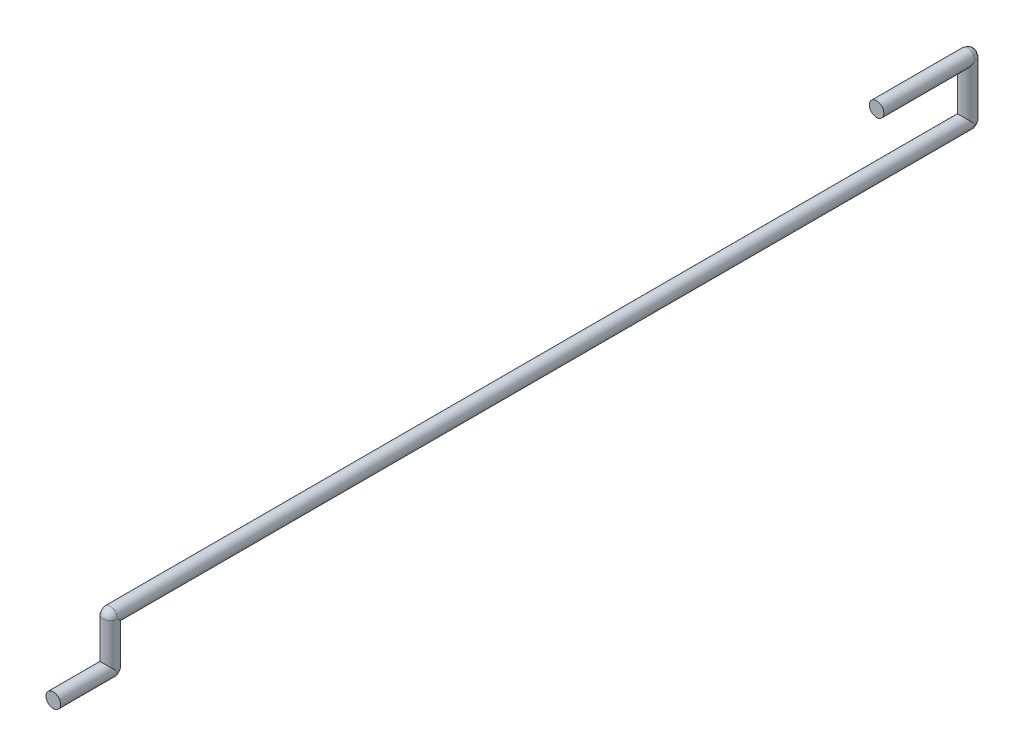
ISO-10303-21;
HEADER;
FILE_DESCRIPTION(('STEP AP214'),'2;1');
FILE_NAME('part.step','',(''),(''),'','','');
FILE_SCHEMA(('AUTOMOTIVE_DESIGN { 1 0 10303 214 1 1 1 1 }'));
ENDSEC;
DATA;
#1=APPLICATION_CONTEXT('core data for automotive mechanical design processes');
#2=APPLICATION_PROTOCOL_DEFINITION('international standard','automotive_design',2000,#1);
#3=PRODUCT_CONTEXT('',#1,'mechanical');
#4=PRODUCT('Part','Part','',(#3));
#5=PRODUCT_RELATED_PRODUCT_CATEGORY('part','',(#4));
#6=PRODUCT_DEFINITION_FORMATION('','',#4);
#7=PRODUCT_DEFINITION_CONTEXT('part definition',#1,'design');
#8=PRODUCT_DEFINITION('design','',#6,#7);
#9=PRODUCT_DEFINITION_SHAPE('','',#8);
#10=(LENGTH_UNIT() NAMED_UNIT(*) SI_UNIT(.MILLI.,.METRE.));
#11=(NAMED_UNIT(*) PLANE_ANGLE_UNIT() SI_UNIT($,.RADIAN.));
#12=(NAMED_UNIT(*) SI_UNIT($,.STERADIAN.) SOLID_ANGLE_UNIT());
#13=UNCERTAINTY_MEASURE_WITH_UNIT(LENGTH_MEASURE(1.E-05),#10,'distance_accuracy_value','');
#14=(GEOMETRIC_REPRESENTATION_CONTEXT(3) GLOBAL_UNCERTAINTY_ASSIGNED_CONTEXT((#13)) GLOBAL_UNIT_ASSIGNED_CONTEXT((#10,
#11,#12)) REPRESENTATION_CONTEXT('',''));
#15=CARTESIAN_POINT('',(0.,0.,0.));
#16=DIRECTION('',(0.,0.,1.));
#17=DIRECTION('',(1.,0.,0.));
#18=AXIS2_PLACEMENT_3D('',#15,#16,#17);
#19=CARTESIAN_POINT('',(0.,-2.54,47.8028));
#20=DIRECTION('',(0.,1.,0.));
#21=DIRECTION('',(0.,0.,1.));
#22=AXIS2_PLACEMENT_3D('',#19,#20,#21);
#23=CYLINDRICAL_SURFACE('',#22,0.4064);
#24=CARTESIAN_POINT('',(0.,0.,47.8028));
#25=DIRECTION('',(0.,0.707106781186548,-0.707106781186547));
#26=DIRECTION('',(0.,-0.707106781186548,-0.707106781186547));
#27=AXIS2_PLACEMENT_3D('',#24,#25,#26);
#28=ELLIPSE('',#27,0.574736391748426,0.4064);
#29=CARTESIAN_POINT('',(0.4064,0.,47.8028));
#30=VERTEX_POINT('',#29);
#31=CARTESIAN_POINT('',(-0.4064,0.,47.8028));
#32=VERTEX_POINT('',#31);
#33=EDGE_CURVE('E179',#30,#32,#28,.T.);
#34=ORIENTED_EDGE('',*,*,#33,.F.);
#35=CARTESIAN_POINT('',(-0.4064,0.,47.8028));
#36=CARTESIAN_POINT('',(-0.4064,0.,47.8559976352546));
#37=CARTESIAN_POINT('',(-0.385247228577065,0.,47.9623931969917));
#38=CARTESIAN_POINT('',(-0.294884096127374,0.,48.0976240319345));
#39=CARTESIAN_POINT('',(-0.159580434220267,0.,48.1880683571422));
#40=CARTESIAN_POINT('',(-0.0531976352546496,0.,48.2092));
#41=CARTESIAN_POINT('',(0.0531976352546502,0.,48.2092));
#42=CARTESIAN_POINT('',(0.159593196991647,0.,48.1880472285771));
#43=CARTESIAN_POINT('',(0.294824031934542,0.,48.0976840961274));
#44=CARTESIAN_POINT('',(0.385268357142196,0.,47.9623804342203));
#45=CARTESIAN_POINT('',(0.4064,0.,47.8559976352546));
#46=CARTESIAN_POINT('',(0.4064,0.,47.8028));
#47=B_SPLINE_CURVE_WITH_KNOTS('',3,(#35,#36,#37,#38,#39,#40,#41,#42,#43,#44,#45,#46),
.UNSPECIFIED.,.F.,.F.,(4,1,1,1,2,1,1,1,4),(0.,0.125,0.25,0.375,0.5,0.625,0.75,0.875,1.),.UNSPECIFIED.);
#48=EDGE_CURVE('E302',#32,#30,#47,.T.);
#49=ORIENTED_EDGE('',*,*,#48,.F.);
#50=EDGE_LOOP('',(#34,#49));
#51=FACE_BOUND('',#50,.T.);
#52=CARTESIAN_POINT('',(-0.4064,-2.54,47.8028));
#53=CARTESIAN_POINT('',(-0.4064,-2.54,47.7496023647453));
#54=CARTESIAN_POINT('',(-0.385247228577063,-2.54,47.6432068030083));
#55=CARTESIAN_POINT('',(-0.294884096127371,-2.54,47.5079759680655));
#56=CARTESIAN_POINT('',(-0.159580434220265,-2.54,47.4175316428577));
#57=CARTESIAN_POINT('',(-0.0531976352546501,-2.54,47.3964));
#58=CARTESIAN_POINT('',(0.0531976352546496,-2.54,47.3964));
#59=CARTESIAN_POINT('',(0.159593196991648,-2.54,47.4175527714229));
#60=CARTESIAN_POINT('',(0.294824031934544,-2.54,47.5079159038726));
#61=CARTESIAN_POINT('',(0.38526835714219,-2.54,47.6432195657797));
#62=CARTESIAN_POINT('',(0.4064,-2.54,47.7496023647453));
#63=CARTESIAN_POINT('',(0.4064,-2.54,47.8028));
#64=B_SPLINE_CURVE_WITH_KNOTS('',3,(#52,#53,#54,#55,#56,#57,#58,#59,#60,#61,#62,#63),
.UNSPECIFIED.,.F.,.F.,(4,1,1,1,2,1,1,1,4),(0.,0.125,0.25,0.375,0.5,0.625,0.75,0.875,1.),.UNSPECIFIED.);
#65=CARTESIAN_POINT('',(0.4064,-2.54,47.8028));
#66=VERTEX_POINT('',#65);
#67=CARTESIAN_POINT('',(-0.4064,-2.54,47.8028));
#68=VERTEX_POINT('',#67);
#69=EDGE_CURVE('E296',#66,#68,#64,.F.);
#70=ORIENTED_EDGE('',*,*,#69,.T.);
#71=CARTESIAN_POINT('',(0.,-2.54,47.8028));
#72=DIRECTION('',(0.,0.707106781186547,-0.707106781186547));
#73=DIRECTION('',(0.,0.707106781186547,0.707106781186547));
#74=AXIS2_PLACEMENT_3D('',#71,#72,#73);
#75=ELLIPSE('',#74,0.574736391748426,0.4064);
#76=EDGE_CURVE('E300',#68,#66,#75,.T.);
#77=ORIENTED_EDGE('',*,*,#76,.T.);
#78=EDGE_LOOP('',(#70,#77));
#79=FACE_BOUND('',#78,.T.);
#80=ADVANCED_FACE('F125',(#51,#79),#23,.T.);
#81=CARTESIAN_POINT('',(0.,0.,47.8028));
#82=DIRECTION('',(0.,0.,-1.));
#83=DIRECTION('',(-1.,0.,0.));
#84=AXIS2_PLACEMENT_3D('',#81,#82,#83);
#85=CYLINDRICAL_SURFACE('',#84,0.4064);
#86=CARTESIAN_POINT('',(0.4064,0.,47.8028));
#87=CARTESIAN_POINT('',(0.4064,0.0531976352546507,47.8028));
#88=CARTESIAN_POINT('',(0.385268357142195,0.159580434220266,47.8028));
#89=CARTESIAN_POINT('',(0.29482403193454,0.294884096127373,47.8028));
#90=CARTESIAN_POINT('',(0.159593196991646,0.385247228577068,47.8028));
#91=CARTESIAN_POINT('',(0.0531976352546507,0.4064,47.8028));
#92=CARTESIAN_POINT('',(-0.0531976352546506,0.4064,47.8028));
#93=CARTESIAN_POINT('',(-0.159580434220266,0.385268357142195,47.8028));
#94=CARTESIAN_POINT('',(-0.294884096127373,0.29482403193454,47.8027999999999));
#95=CARTESIAN_POINT('',(-0.385247228577068,0.159593196991646,47.8028));
#96=CARTESIAN_POINT('',(-0.4064,0.0531976352546507,47.8028));
#97=CARTESIAN_POINT('',(-0.4064,0.,47.8028));
#98=B_SPLINE_CURVE_WITH_KNOTS('',3,(#86,#87,#88,#89,#90,#91,#92,#93,#94,#95,#96,#97),
.UNSPECIFIED.,.F.,.F.,(4,1,1,1,2,1,1,1,4),(0.,0.125,0.25,0.375,0.5,0.625,0.75,0.875,1.),.UNSPECIFIED.);
#99=EDGE_CURVE('E13',#30,#32,#98,.T.);
#100=ORIENTED_EDGE('',*,*,#99,.F.);
#101=ORIENTED_EDGE('',*,*,#33,.T.);
#102=EDGE_LOOP('',(#100,#101));
#103=FACE_BOUND('',#102,.T.);
#104=CARTESIAN_POINT('',(0.,0.,0.));
#105=DIRECTION('',(0.,0.707106781186547,-0.707106781186547));
#106=DIRECTION('',(0.,-0.707106781186547,-0.707106781186547));
#107=AXIS2_PLACEMENT_3D('',#104,#105,#106);
#108=ELLIPSE('',#107,0.574736391748426,0.4064);
#109=CARTESIAN_POINT('',(-0.4064,0.,0.));
#110=VERTEX_POINT('',#109);
#111=CARTESIAN_POINT('',(0.4064,0.,0.));
#112=VERTEX_POINT('',#111);
#113=EDGE_CURVE('E184',#110,#112,#108,.T.);
#114=ORIENTED_EDGE('',*,*,#113,.F.);
#115=CARTESIAN_POINT('',(0.4064,0.,0.));
#116=CARTESIAN_POINT('',(0.4064,-0.0531976352546507,0.));
#117=CARTESIAN_POINT('',(0.385268357142195,-0.159580434220266,0.));
#118=CARTESIAN_POINT('',(0.29482403193454,-0.294884096127373,0.));
#119=CARTESIAN_POINT('',(0.159593196991646,-0.385247228577068,0.));
#120=CARTESIAN_POINT('',(0.0531976352546506,-0.4064,0.));
#121=CARTESIAN_POINT('',(-0.0531976352546507,-0.4064,0.));
#122=CARTESIAN_POINT('',(-0.159580434220267,-0.385268357142195,0.));
#123=CARTESIAN_POINT('',(-0.294884096127373,-0.29482403193454,0.));
#124=CARTESIAN_POINT('',(-0.385247228577069,-0.159593196991646,0.));
#125=CARTESIAN_POINT('',(-0.4064,-0.0531976352546506,0.));
#126=CARTESIAN_POINT('',(-0.4064,0.,0.));
#127=B_SPLINE_CURVE_WITH_KNOTS('',3,(#115,#116,#117,#118,#119,#120,#121,#122,#123,#124,#125,
#126),.UNSPECIFIED.,.F.,.F.,(4,1,1,1,2,1,1,1,4),(0.,0.125,0.25,0.375,0.5,0.625,0.75,0.875,1.),.UNSPECIFIED.);
#128=EDGE_CURVE('E136',#110,#112,#127,.F.);
#129=ORIENTED_EDGE('',*,*,#128,.T.);
#130=EDGE_LOOP('',(#114,#129));
#131=FACE_BOUND('',#130,.T.);
#132=ADVANCED_FACE('F127',(#103,#131),#85,.T.);
#133=CARTESIAN_POINT('',(0.,3.048,0.));
#134=DIRECTION('',(0.,-1.,0.));
#135=DIRECTION('',(0.,0.,-1.));
#136=AXIS2_PLACEMENT_3D('',#133,#134,#135);
#137=CYLINDRICAL_SURFACE('',#136,0.4064);
#138=CARTESIAN_POINT('',(0.4064,3.048,0.));
#139=CARTESIAN_POINT('',(0.4064,3.048,-0.0531976352546506));
#140=CARTESIAN_POINT('',(0.385247228577068,3.048,-0.159593196991646));
#141=CARTESIAN_POINT('',(0.294884096127373,3.048,-0.29482403193454));
#142=CARTESIAN_POINT('',(0.159580434220266,3.048,-0.385268357142195));
#143=CARTESIAN_POINT('',(0.0531976352546507,3.048,-0.4064));
#144=CARTESIAN_POINT('',(-0.0531976352546506,3.048,-0.4064));
#145=CARTESIAN_POINT('',(-0.159593196991646,3.048,-0.385247228577068));
#146=CARTESIAN_POINT('',(-0.294824031934539,3.048,-0.294884096127373));
#147=CARTESIAN_POINT('',(-0.385268357142196,3.048,-0.159580434220266));
#148=CARTESIAN_POINT('',(-0.4064,3.048,-0.0531976352546507));
#149=CARTESIAN_POINT('',(-0.4064,3.048,0.));
#150=B_SPLINE_CURVE_WITH_KNOTS('',3,(#138,#139,#140,#141,#142,#143,#144,#145,#146,#147,#148,
#149),.UNSPECIFIED.,.F.,.F.,(4,1,1,1,2,1,1,1,4),(0.,0.125,0.25,0.375,0.5,0.625,0.75,0.875,1.),.UNSPECIFIED.);
#151=CARTESIAN_POINT('',(0.4064,3.048,0.));
#152=VERTEX_POINT('',#151);
#153=CARTESIAN_POINT('',(-0.4064,3.048,0.));
#154=VERTEX_POINT('',#153);
#155=EDGE_CURVE('E142',#152,#154,#150,.T.);
#156=ORIENTED_EDGE('',*,*,#155,.F.);
#157=CARTESIAN_POINT('',(0.,3.048,0.));
#158=DIRECTION('',(0.,-0.707106781186547,-0.707106781186548));
#159=DIRECTION('',(0.,-0.707106781186547,0.707106781186548));
#160=AXIS2_PLACEMENT_3D('',#157,#158,#159);
#161=ELLIPSE('',#160,0.574736391748426,0.4064);
#162=EDGE_CURVE('E253',#152,#154,#161,.T.);
#163=ORIENTED_EDGE('',*,*,#162,.T.);
#164=EDGE_LOOP('',(#156,#163));
#165=FACE_BOUND('',#164,.T.);
#166=CARTESIAN_POINT('',(-0.4064,0.,0.));
#167=CARTESIAN_POINT('',(-0.4064,0.,-0.0531976352546507));
#168=CARTESIAN_POINT('',(-0.385247228577068,0.,-0.159593196991646));
#169=CARTESIAN_POINT('',(-0.294884096127373,0.,-0.29482403193454));
#170=CARTESIAN_POINT('',(-0.159580434220266,0.,-0.385268357142195));
#171=CARTESIAN_POINT('',(-0.0531976352546506,0.,-0.4064));
#172=CARTESIAN_POINT('',(0.0531976352546507,0.,-0.4064));
#173=CARTESIAN_POINT('',(0.159593196991646,0.,-0.385247228577068));
#174=CARTESIAN_POINT('',(0.29482403193454,0.,-0.294884096127373));
#175=CARTESIAN_POINT('',(0.385268357142195,0.,-0.159580434220266));
#176=CARTESIAN_POINT('',(0.4064,0.,-0.0531976352546506));
#177=CARTESIAN_POINT('',(0.4064,0.,0.));
#178=B_SPLINE_CURVE_WITH_KNOTS('',3,(#166,#167,#168,#169,#170,#171,#172,#173,#174,#175,#176,
#177),.UNSPECIFIED.,.F.,.F.,(4,1,1,1,2,1,1,1,4),(0.,0.125,0.25,0.375,0.5,0.625,0.75,0.875,1.),.UNSPECIFIED.);
#179=EDGE_CURVE('E171',#112,#110,#178,.F.);
#180=ORIENTED_EDGE('',*,*,#179,.T.);
#181=ORIENTED_EDGE('',*,*,#113,.T.);
#182=EDGE_LOOP('',(#180,#181));
#183=FACE_BOUND('',#182,.T.);
#184=ADVANCED_FACE('F187',(#165,#183),#137,.T.);
#185=CARTESIAN_POINT('',(0.,-2.54,50.9778));
#186=DIRECTION('',(0.,0.,-1.));
#187=DIRECTION('',(-1.,0.,0.));
#188=AXIS2_PLACEMENT_3D('',#185,#186,#187);
#189=CYLINDRICAL_SURFACE('',#188,0.4064);
#190=ORIENTED_EDGE('',*,*,#76,.F.);
#191=CARTESIAN_POINT('',(0.4064,-2.54,47.8028));
#192=CARTESIAN_POINT('',(0.4064,-2.59319763525465,47.8028));
#193=CARTESIAN_POINT('',(0.385268357142195,-2.69958043422026,47.8028));
#194=CARTESIAN_POINT('',(0.294824031934539,-2.83488409612737,47.8028));
#195=CARTESIAN_POINT('',(0.159593196991646,-2.92524722857707,47.8028));
#196=CARTESIAN_POINT('',(0.0531976352546505,-2.9464,47.8028));
#197=CARTESIAN_POINT('',(-0.0531976352546507,-2.9464,47.8028));
#198=CARTESIAN_POINT('',(-0.159580434220266,-2.92526835714219,47.8027999999999));
#199=CARTESIAN_POINT('',(-0.294884096127373,-2.83482403193454,47.8028));
#200=CARTESIAN_POINT('',(-0.385247228577068,-2.69959319699165,47.8027999999999));
#201=CARTESIAN_POINT('',(-0.4064,-2.59319763525465,47.8028));
#202=CARTESIAN_POINT('',(-0.4064,-2.54,47.8028));
#203=B_SPLINE_CURVE_WITH_KNOTS('',3,(#191,#192,#193,#194,#195,#196,#197,#198,#199,#200,#201,
#202),.UNSPECIFIED.,.F.,.F.,(4,1,1,1,2,1,1,1,4),(0.,0.125,0.25,0.375,0.5,0.625,0.75,0.875,1.),.UNSPECIFIED.);
#204=EDGE_CURVE('E150',#68,#66,#203,.F.);
#205=ORIENTED_EDGE('',*,*,#204,.T.);
#206=EDGE_LOOP('',(#190,#205));
#207=FACE_BOUND('',#206,.T.);
#208=CARTESIAN_POINT('',(0.,-2.54,50.9778));
#209=DIRECTION('',(0.,0.,1.));
#210=DIRECTION('',(1.,0.,0.));
#211=AXIS2_PLACEMENT_3D('',#208,#209,#210);
#212=CIRCLE('',#211,0.4064);
#213=CARTESIAN_POINT('',(0.4064,-2.54,50.9778));
#214=VERTEX_POINT('',#213);
#215=EDGE_CURVE('E303',#214,#214,#212,.T.);
#216=ORIENTED_EDGE('',*,*,#215,.F.);
#217=EDGE_LOOP('',(#216));
#218=FACE_BOUND('',#217,.T.);
#219=ADVANCED_FACE('F271',(#207,#218),#189,.T.);
#220=CARTESIAN_POINT('',(0.,-2.54,50.9778));
#221=DIRECTION('',(0.,0.,1.));
#222=DIRECTION('',(1.,0.,0.));
#223=AXIS2_PLACEMENT_3D('',#220,#221,#222);
#224=PLANE('',#223);
#225=ORIENTED_EDGE('',*,*,#215,.T.);
#226=EDGE_LOOP('',(#225));
#227=FACE_BOUND('',#226,.T.);
#228=ADVANCED_FACE('F356',(#227),#224,.T.);
#229=CARTESIAN_POINT('',(0.4064,0.,47.8028));
#230=CARTESIAN_POINT('',(0.4064,0.,47.8028));
#231=CARTESIAN_POINT('',(0.4064,0.,47.8028));
#232=CARTESIAN_POINT('',(0.4064,0.,47.8028));
#233=CARTESIAN_POINT('',(0.4064,0.,47.8028));
#234=CARTESIAN_POINT('',(0.4064,0.,47.8028));
#235=CARTESIAN_POINT('',(0.4064,0.,47.8028));
#236=CARTESIAN_POINT('',(0.4064,0.,47.8028));
#237=CARTESIAN_POINT('',(0.4064,0.,47.8028));
#238=CARTESIAN_POINT('',(0.4064,0.,47.8028));
#239=CARTESIAN_POINT('',(0.4064,0.0537296116071972,47.8022680236474));
#240=CARTESIAN_POINT('',(0.4064,0.0535522861563483,47.8024453490983));
#241=CARTESIAN_POINT('',(0.4064,0.0533749607054995,47.8026226745491));
#242=CARTESIAN_POINT('',(0.4064,0.0531976352546507,47.8028));
#243=CARTESIAN_POINT('',(0.4064,0.0354650901697671,47.8205325450849));
#244=CARTESIAN_POINT('',(0.4064,0.0177325450848836,47.8382650901698));
#245=CARTESIAN_POINT('',(0.4064,0.,47.8559976352546));
#246=CARTESIAN_POINT('',(0.4064,-0.000177325450848836,47.8561749607055));
#247=CARTESIAN_POINT('',(0.4064,-0.000354650901697671,47.8563522861563));
#248=CARTESIAN_POINT('',(0.4064,-0.000531976352546507,47.8565296116072));
#249=CARTESIAN_POINT('',(0.385268357142195,0.160667391910235,47.8009035802465));
#250=CARTESIAN_POINT('',(0.385268357142195,0.160305072680245,47.8015357201643));
#251=CARTESIAN_POINT('',(0.385268357142195,0.159942753450256,47.8021678600821));
#252=CARTESIAN_POINT('',(0.385268357142195,0.159580434220266,47.8028));
#253=CARTESIAN_POINT('',(0.385268357142196,0.1233485112213,47.8660139917834));
#254=CARTESIAN_POINT('',(0.385268357142196,0.0632139917833993,47.9261485112213));
#255=CARTESIAN_POINT('',(0.385268357142196,0.,47.9623804342203));
#256=CARTESIAN_POINT('',(0.385268357142196,-0.000632139917833993,47.9627427534503));
#257=CARTESIAN_POINT('',(0.385268357142196,-0.00126427983566799,47.9631050726802));
#258=CARTESIAN_POINT('',(0.385268357142196,-0.00189641975350198,47.9634673919102));
#259=CARTESIAN_POINT('',(0.29482403193454,0.295797550479713,47.7986486973935));
#260=CARTESIAN_POINT('',(0.29482403193454,0.2954930656956,47.800032464929));
#261=CARTESIAN_POINT('',(0.29482403193454,0.295188580911487,47.8014162324645));
#262=CARTESIAN_POINT('',(0.29482403193454,0.294884096127373,47.8028));
#263=CARTESIAN_POINT('',(0.29482403193454,0.264435617716072,47.941176753549));
#264=CARTESIAN_POINT('',(0.294824031934541,0.138376753549034,48.0672356177161));
#265=CARTESIAN_POINT('',(0.294824031934542,0.,48.0976840961274));
#266=CARTESIAN_POINT('',(0.294824031934542,-0.00138376753549034,48.0979885809115));
#267=CARTESIAN_POINT('',(0.294824031934542,-0.00276753507098068,48.0982930656956));
#268=CARTESIAN_POINT('',(0.294824031934542,-0.00415130260647102,48.0985975504797));
#269=CARTESIAN_POINT('',(0.159593196991646,0.385537774297203,47.7968432198351));
#270=CARTESIAN_POINT('',(0.159593196991646,0.385440925723824,47.7988288132234));
#271=CARTESIAN_POINT('',(0.159593196991646,0.385344077150446,47.8008144066117));
#272=CARTESIAN_POINT('',(0.159593196991646,0.385247228577068,47.8028));
#273=CARTESIAN_POINT('',(0.159593196991646,0.375562371239235,48.0013593388288));
#274=CARTESIAN_POINT('',(0.159593196991647,0.198559338828864,48.1783623712393));
#275=CARTESIAN_POINT('',(0.159593196991647,0.,48.1880472285771));
#276=CARTESIAN_POINT('',(0.159593196991647,-0.00198559338828864,48.1881440771504));
#277=CARTESIAN_POINT('',(0.159593196991647,-0.00397118677657728,48.1882409257238));
#278=CARTESIAN_POINT('',(0.159593196991647,-0.00595678016486592,48.1883377742972));
#279=CARTESIAN_POINT('',(0.0531976352546507,0.406393226782131,47.7963310767096));
#280=CARTESIAN_POINT('',(0.0531976352546507,0.406395484521421,47.7984873844731));
#281=CARTESIAN_POINT('',(0.0531976352546507,0.406397742260711,47.8006436922365));
#282=CARTESIAN_POINT('',(0.0531976352546507,0.4064,47.8028));
#283=CARTESIAN_POINT('',(0.0531976352546504,0.406625773928979,48.0184307763465));
#284=CARTESIAN_POINT('',(0.0531976352546501,0.215630776346485,48.209425773929));
#285=CARTESIAN_POINT('',(0.0531976352546502,0.,48.2092));
#286=CARTESIAN_POINT('',(0.0531976352546502,-0.00215630776346485,48.2091977422607));
#287=CARTESIAN_POINT('',(0.0531976352546502,-0.00431261552692971,48.2091954845214));
#288=CARTESIAN_POINT('',(0.0531976352546502,-0.00646892329039456,48.2091932267821));
#289=CARTESIAN_POINT('',(-0.0531976352546506,0.406393226782131,47.7963310767096));
#290=CARTESIAN_POINT('',(-0.0531976352546506,0.406395484521421,47.7984873844731));
#291=CARTESIAN_POINT('',(-0.0531976352546506,0.406397742260711,47.8006436922365));
#292=CARTESIAN_POINT('',(-0.0531976352546506,0.4064,47.8028));
#293=CARTESIAN_POINT('',(-0.0531976352546504,0.406625773928979,48.0184307763465));
#294=CARTESIAN_POINT('',(-0.0531976352546501,0.215630776346485,48.209425773929));
#295=CARTESIAN_POINT('',(-0.0531976352546496,0.,48.2092));
#296=CARTESIAN_POINT('',(-0.0531976352546496,-0.00215630776346485,48.2091977422607));
#297=CARTESIAN_POINT('',(-0.0531976352546496,-0.00431261552692971,48.2091954845214));
#298=CARTESIAN_POINT('',(-0.0531976352546495,-0.00646892329039456,48.2091932267821));
#299=CARTESIAN_POINT('',(-0.159580434220266,0.385559114147982,47.7968430085495));
#300=CARTESIAN_POINT('',(-0.159580434220266,0.385462195146053,47.7988286723663));
#301=CARTESIAN_POINT('',(-0.159580434220266,0.385365276144124,47.8008143361832));
#302=CARTESIAN_POINT('',(-0.159580434220266,0.385268357142195,47.8028));
#303=CARTESIAN_POINT('',(-0.159580434220267,0.37557645694932,48.0013663816839));
#304=CARTESIAN_POINT('',(-0.159580434220267,0.198566381683906,48.1783764569493));
#305=CARTESIAN_POINT('',(-0.159580434220267,0.,48.1880683571422));
#306=CARTESIAN_POINT('',(-0.159580434220267,-0.00198566381683906,48.1881652761441));
#307=CARTESIAN_POINT('',(-0.159580434220267,-0.00397132763367813,48.188262195146));
#308=CARTESIAN_POINT('',(-0.159580434220267,-0.00595699145051719,48.1883591141479));
#309=CARTESIAN_POINT('',(-0.294884096127373,0.295736885644951,47.7986492980354));
#310=CARTESIAN_POINT('',(-0.294884096127373,0.295432601074814,47.8000328653569));
#311=CARTESIAN_POINT('',(-0.294884096127373,0.295128316504677,47.8014164326784));
#312=CARTESIAN_POINT('',(-0.294884096127373,0.29482403193454,47.8027999999999));
#313=CARTESIAN_POINT('',(-0.294884096127373,0.26439557492085,47.9411567321514));
#314=CARTESIAN_POINT('',(-0.294884096127374,0.138356732151423,48.0671955749208));
#315=CARTESIAN_POINT('',(-0.294884096127374,0.,48.0976240319345));
#316=CARTESIAN_POINT('',(-0.294884096127374,-0.00138356732151423,48.0979283165047));
#317=CARTESIAN_POINT('',(-0.294884096127374,-0.00276713464302845,48.0982326010748));
#318=CARTESIAN_POINT('',(-0.294884096127374,-0.00415070196454268,48.0985368856449));
#319=CARTESIAN_POINT('',(-0.385247228577068,0.160680282309329,47.8009034526188));
#320=CARTESIAN_POINT('',(-0.385247228577068,0.160317920536768,47.8015356350792));
#321=CARTESIAN_POINT('',(-0.385247228577068,0.159955558764207,47.8021678175396));
#322=CARTESIAN_POINT('',(-0.385247228577068,0.159593196991646,47.8028));
#323=CARTESIAN_POINT('',(-0.385247228577067,0.123357019735553,47.8660182460406));
#324=CARTESIAN_POINT('',(-0.385247228577066,0.063218246040526,47.9261570197356));
#325=CARTESIAN_POINT('',(-0.385247228577065,0.,47.9623931969917));
#326=CARTESIAN_POINT('',(-0.385247228577065,-0.000632182460405261,47.9627555587642));
#327=CARTESIAN_POINT('',(-0.385247228577065,-0.00126436492081052,47.9631179205368));
#328=CARTESIAN_POINT('',(-0.385247228577065,-0.00189654738121578,47.9634802823093));
#329=CARTESIAN_POINT('',(-0.4064,0.0537296116071972,47.8022680236474));
#330=CARTESIAN_POINT('',(-0.4064,0.0535522861563484,47.8024453490983));
#331=CARTESIAN_POINT('',(-0.4064,0.0533749607054995,47.8026226745491));
#332=CARTESIAN_POINT('',(-0.4064,0.0531976352546507,47.8028));
#333=CARTESIAN_POINT('',(-0.4064,0.0354650901697671,47.8205325450849));
#334=CARTESIAN_POINT('',(-0.4064,0.0177325450848836,47.8382650901698));
#335=CARTESIAN_POINT('',(-0.4064,0.,47.8559976352546));
#336=CARTESIAN_POINT('',(-0.4064,-0.000177325450848836,47.8561749607055));
#337=CARTESIAN_POINT('',(-0.4064,-0.000354650901697672,47.8563522861563));
#338=CARTESIAN_POINT('',(-0.4064,-0.000531976352546508,47.8565296116072));
#339=CARTESIAN_POINT('',(-0.4064,0.,47.8028));
#340=CARTESIAN_POINT('',(-0.4064,0.,47.8028));
#341=CARTESIAN_POINT('',(-0.4064,0.,47.8028));
#342=CARTESIAN_POINT('',(-0.4064,0.,47.8028));
#343=CARTESIAN_POINT('',(-0.4064,0.,47.8028));
#344=CARTESIAN_POINT('',(-0.4064,0.,47.8028));
#345=CARTESIAN_POINT('',(-0.4064,0.,47.8028));
#346=CARTESIAN_POINT('',(-0.4064,0.,47.8028));
#347=CARTESIAN_POINT('',(-0.4064,0.,47.8028));
#348=CARTESIAN_POINT('',(-0.4064,0.,47.8028));
#349=B_SPLINE_SURFACE_WITH_KNOTS('',3,3,((#229,#230,#231,#232,#233,#234,#235,#236,#237,#238),
(#239,#240,#241,#242,#243,#244,#245,#246,#247,#248),(#249,#250,#251,#252,#253,#254,#255,#256,
#257,#258),(#259,#260,#261,#262,#263,#264,#265,#266,#267,#268),(#269,#270,#271,#272,#273,#274,
#275,#276,#277,#278),(#279,#280,#281,#282,#283,#284,#285,#286,#287,#288),(#289,#290,#291,#292,
#293,#294,#295,#296,#297,#298),(#299,#300,#301,#302,#303,#304,#305,#306,#307,#308),(#309,#310,
#311,#312,#313,#314,#315,#316,#317,#318),(#319,#320,#321,#322,#323,#324,#325,#326,#327,#328),
(#329,#330,#331,#332,#333,#334,#335,#336,#337,#338),(#339,#340,#341,#342,#343,#344,#345,#346,
#347,#348)),.UNSPECIFIED.,.F.,.F.,.F.,(4,1,1,1,2,1,1,1,4),(4,3,3,4),(0.,0.125,0.25,0.375,0.5,
0.625,0.75,0.875,1.),(-0.01,0.,1.,1.01),.UNSPECIFIED.);
#350=ORIENTED_EDGE('',*,*,#99,.T.);
#351=ORIENTED_EDGE('',*,*,#48,.T.);
#352=EDGE_LOOP('',(#350,#351));
#353=FACE_BOUND('',#352,.T.);
#354=ADVANCED_FACE('F339',(#353),#349,.T.);
#355=CARTESIAN_POINT('',(0.4064,-2.54,47.8028));
#356=CARTESIAN_POINT('',(0.4064,-2.54,47.8028));
#357=CARTESIAN_POINT('',(0.4064,-2.54,47.8028));
#358=CARTESIAN_POINT('',(0.4064,-2.54,47.8028));
#359=CARTESIAN_POINT('',(0.4064,-2.59319763525465,47.8028));
#360=CARTESIAN_POINT('',(0.4064,-2.57546509016977,47.7850674549151));
#361=CARTESIAN_POINT('',(0.4064,-2.55773254508488,47.7673349098302));
#362=CARTESIAN_POINT('',(0.4064,-2.54,47.7496023647453));
#363=CARTESIAN_POINT('',(0.385268357142195,-2.69958043422026,47.8028));
#364=CARTESIAN_POINT('',(0.385268357142193,-2.66356642859157,47.7395201375058));
#365=CARTESIAN_POINT('',(0.385268357142192,-2.60327986249421,47.6792335714084));
#366=CARTESIAN_POINT('',(0.38526835714219,-2.54,47.6432195657797));
#367=CARTESIAN_POINT('',(0.294824031934539,-2.83488409612737,47.8028));
#368=CARTESIAN_POINT('',(0.294824031934541,-2.80530728719717,47.6641597636077));
#369=CARTESIAN_POINT('',(0.294824031934542,-2.67864023639228,47.5374927128028));
#370=CARTESIAN_POINT('',(0.294824031934544,-2.54,47.5079159038726));
#371=CARTESIAN_POINT('',(0.159593196991646,-2.92524722857707,47.8028));
#372=CARTESIAN_POINT('',(0.159593196991646,-2.91708779283115,47.6037795661955));
#373=CARTESIAN_POINT('',(0.159593196991647,-2.73902043380455,47.4257122071689));
#374=CARTESIAN_POINT('',(0.159593196991648,-2.54,47.4175527714229));
#375=CARTESIAN_POINT('',(0.0531976352546505,-2.9464,47.8028));
#376=CARTESIAN_POINT('',(0.0531976352546504,-2.94836911289117,47.586642257967));
#377=CARTESIAN_POINT('',(0.0531976352546501,-2.75615774203299,47.3944308871088));
#378=CARTESIAN_POINT('',(0.0531976352546496,-2.54,47.3964));
#379=CARTESIAN_POINT('',(-0.0531976352546507,-2.9464,47.8028));
#380=CARTESIAN_POINT('',(-0.0531976352546504,-2.94836911289117,47.586642257967));
#381=CARTESIAN_POINT('',(-0.0531976352546501,-2.75615774203299,47.3944308871088));
#382=CARTESIAN_POINT('',(-0.0531976352546501,-2.54,47.3964));
#383=CARTESIAN_POINT('',(-0.159580434220266,-2.92526835714219,47.8027999999999));
#384=CARTESIAN_POINT('',(-0.159580434220266,-2.91710187854124,47.6037725233404));
#385=CARTESIAN_POINT('',(-0.159580434220265,-2.7390274766596,47.4256981214587));
#386=CARTESIAN_POINT('',(-0.159580434220265,-2.54,47.4175316428577));
#387=CARTESIAN_POINT('',(-0.294884096127373,-2.83482403193454,47.8028));
#388=CARTESIAN_POINT('',(-0.294884096127372,-2.80526724440194,47.6641797850054));
#389=CARTESIAN_POINT('',(-0.294884096127371,-2.67862021499467,47.5375327555981));
#390=CARTESIAN_POINT('',(-0.294884096127371,-2.54,47.5079759680655));
#391=CARTESIAN_POINT('',(-0.385247228577068,-2.69959319699165,47.8027999999999));
#392=CARTESIAN_POINT('',(-0.385247228577066,-2.66357493710583,47.7395158832486));
#393=CARTESIAN_POINT('',(-0.385247228577065,-2.60328411675134,47.6792250628941));
#394=CARTESIAN_POINT('',(-0.385247228577063,-2.54,47.6432068030083));
#395=CARTESIAN_POINT('',(-0.4064,-2.59319763525465,47.8028));
#396=CARTESIAN_POINT('',(-0.4064,-2.57546509016977,47.7850674549151));
#397=CARTESIAN_POINT('',(-0.4064,-2.55773254508488,47.7673349098302));
#398=CARTESIAN_POINT('',(-0.4064,-2.54,47.7496023647453));
#399=CARTESIAN_POINT('',(-0.4064,-2.54,47.8028));
#400=CARTESIAN_POINT('',(-0.4064,-2.54,47.8028));
#401=CARTESIAN_POINT('',(-0.4064,-2.54,47.8028));
#402=CARTESIAN_POINT('',(-0.4064,-2.54,47.8028));
#403=B_SPLINE_SURFACE_WITH_KNOTS('',3,3,((#355,#356,#357,#358),(#359,#360,#361,#362),(#363,#364,
#365,#366),(#367,#368,#369,#370),(#371,#372,#373,#374),(#375,#376,#377,#378),(#379,#380,#381,
#382),(#383,#384,#385,#386),(#387,#388,#389,#390),(#391,#392,#393,#394),(#395,#396,#397,#398),
(#399,#400,#401,#402)),.UNSPECIFIED.,.F.,.F.,.F.,(4,1,1,1,2,1,1,1,4),(4,4),(0.,0.125,0.25,0.375,
0.5,0.625,0.75,0.875,1.),(0.,1.),.UNSPECIFIED.);
#404=ORIENTED_EDGE('',*,*,#204,.F.);
#405=ORIENTED_EDGE('',*,*,#69,.F.);
#406=EDGE_LOOP('',(#404,#405));
#407=FACE_BOUND('',#406,.T.);
#408=ADVANCED_FACE('F241',(#407),#403,.T.);
#409=CARTESIAN_POINT('',(0.,3.048,5.08));
#410=DIRECTION('',(0.,0.,-1.));
#411=DIRECTION('',(-1.,0.,0.));
#412=AXIS2_PLACEMENT_3D('',#409,#410,#411);
#413=CYLINDRICAL_SURFACE('',#412,0.4064);
#414=CARTESIAN_POINT('',(0.,3.048,5.08));
#415=DIRECTION('',(0.,0.,-1.));
#416=DIRECTION('',(-1.,0.,0.));
#417=AXIS2_PLACEMENT_3D('',#414,#415,#416);
#418=CIRCLE('',#417,0.4064);
#419=CARTESIAN_POINT('',(-0.4064,3.048,5.08));
#420=VERTEX_POINT('',#419);
#421=EDGE_CURVE('E212',#420,#420,#418,.T.);
#422=ORIENTED_EDGE('',*,*,#421,.T.);
#423=EDGE_LOOP('',(#422));
#424=FACE_BOUND('',#423,.T.);
#425=ORIENTED_EDGE('',*,*,#162,.F.);
#426=CARTESIAN_POINT('',(-0.4064,3.048,0.));
#427=CARTESIAN_POINT('',(-0.4064,3.10119763525465,0.));
#428=CARTESIAN_POINT('',(-0.385268357142196,3.20758043422027,0.));
#429=CARTESIAN_POINT('',(-0.29482403193454,3.34288409612737,0.));
#430=CARTESIAN_POINT('',(-0.159593196991646,3.43324722857707,0.));
#431=CARTESIAN_POINT('',(-0.0531976352546507,3.4544,0.));
#432=CARTESIAN_POINT('',(0.0531976352546505,3.4544,0.));
#433=CARTESIAN_POINT('',(0.159580434220266,3.43326835714219,0.));
#434=CARTESIAN_POINT('',(0.294884096127373,3.34282403193455,0.));
#435=CARTESIAN_POINT('',(0.385247228577068,3.20759319699164,0.));
#436=CARTESIAN_POINT('',(0.4064,3.10119763525465,0.));
#437=CARTESIAN_POINT('',(0.4064,3.048,0.));
#438=B_SPLINE_CURVE_WITH_KNOTS('',3,(#426,#427,#428,#429,#430,#431,#432,#433,#434,#435,#436,
#437),.UNSPECIFIED.,.F.,.F.,(4,1,1,1,2,1,1,1,4),(0.,0.125,0.25,0.375,0.5,0.625,0.75,0.875,1.),.UNSPECIFIED.);
#439=EDGE_CURVE('E202',#154,#152,#438,.T.);
#440=ORIENTED_EDGE('',*,*,#439,.F.);
#441=EDGE_LOOP('',(#425,#440));
#442=FACE_BOUND('',#441,.T.);
#443=ADVANCED_FACE('F236',(#424,#442),#413,.T.);
#444=CARTESIAN_POINT('',(0.,3.048,5.08));
#445=DIRECTION('',(0.,0.,-1.));
#446=DIRECTION('',(-1.,0.,0.));
#447=AXIS2_PLACEMENT_3D('',#444,#445,#446);
#448=PLANE('',#447);
#449=ORIENTED_EDGE('',*,*,#421,.F.);
#450=EDGE_LOOP('',(#449));
#451=FACE_BOUND('',#450,.T.);
#452=ADVANCED_FACE('F224',(#451),#448,.F.);
#453=CARTESIAN_POINT('',(-0.4064,3.048,0.));
#454=CARTESIAN_POINT('',(-0.4064,3.048,0.));
#455=CARTESIAN_POINT('',(-0.4064,3.048,0.));
#456=CARTESIAN_POINT('',(-0.4064,3.048,0.));
#457=CARTESIAN_POINT('',(-0.4064,3.10119763525465,0.));
#458=CARTESIAN_POINT('',(-0.4064,3.08346509016977,-0.0177325450848836));
#459=CARTESIAN_POINT('',(-0.4064,3.06573254508488,-0.0354650901697672));
#460=CARTESIAN_POINT('',(-0.4064,3.048,-0.0531976352546507));
#461=CARTESIAN_POINT('',(-0.385268357142196,3.20758043422027,0.));
#462=CARTESIAN_POINT('',(-0.385268357142196,3.17115890485115,-0.0642309390854572));
#463=CARTESIAN_POINT('',(-0.385268357142196,3.11223093908546,-0.12315890485115));
#464=CARTESIAN_POINT('',(-0.385268357142196,3.048,-0.159580434220266));
#465=CARTESIAN_POINT('',(-0.29482403193454,3.34288409612737,0.));
#466=CARTESIAN_POINT('',(-0.294824031934539,3.31167719223547,-0.142444542757265));
#467=CARTESIAN_POINT('',(-0.294824031934539,3.19044454275726,-0.263677192235471));
#468=CARTESIAN_POINT('',(-0.294824031934539,3.048,-0.294884096127373));
#469=CARTESIAN_POINT('',(-0.159593196991646,3.43324722857707,0.));
#470=CARTESIAN_POINT('',(-0.159593196991646,3.42223512664819,-0.205677969943268));
#471=CARTESIAN_POINT('',(-0.159593196991646,3.25367796994327,-0.374235126648184));
#472=CARTESIAN_POINT('',(-0.159593196991646,3.048,-0.385247228577068));
#473=CARTESIAN_POINT('',(-0.0531976352546507,3.4544,0.));
#474=CARTESIAN_POINT('',(-0.0531976352546506,3.45310892296778,-0.223766354762947));
#475=CARTESIAN_POINT('',(-0.0531976352546507,3.27176635476295,-0.405108922967778));
#476=CARTESIAN_POINT('',(-0.0531976352546506,3.048,-0.4064));
#477=CARTESIAN_POINT('',(0.0531976352546505,3.4544,0.));
#478=CARTESIAN_POINT('',(0.0531976352546506,3.45310892296778,-0.223766354762947));
#479=CARTESIAN_POINT('',(0.0531976352546507,3.27176635476295,-0.405108922967778));
#480=CARTESIAN_POINT('',(0.0531976352546507,3.048,-0.4064));
#481=CARTESIAN_POINT('',(0.159580434220266,3.43326835714219,0.));
#482=CARTESIAN_POINT('',(0.159580434220266,3.42224921235826,-0.20568501279831));
#483=CARTESIAN_POINT('',(0.159580434220266,3.25368501279831,-0.374249212358269));
#484=CARTESIAN_POINT('',(0.159580434220266,3.048,-0.385268357142195));
#485=CARTESIAN_POINT('',(0.294884096127373,3.34282403193455,0.));
#486=CARTESIAN_POINT('',(0.294884096127373,3.31163714944025,-0.142424521359654));
#487=CARTESIAN_POINT('',(0.294884096127373,3.19042452135966,-0.263637149440249));
#488=CARTESIAN_POINT('',(0.294884096127373,3.048,-0.29482403193454));
#489=CARTESIAN_POINT('',(0.385247228577068,3.20759319699164,0.));
#490=CARTESIAN_POINT('',(0.385247228577068,3.1711674133654,-0.0642351933425836));
#491=CARTESIAN_POINT('',(0.385247228577068,3.11223519334258,-0.123167413365403));
#492=CARTESIAN_POINT('',(0.385247228577068,3.048,-0.159593196991646));
#493=CARTESIAN_POINT('',(0.4064,3.10119763525465,0.));
#494=CARTESIAN_POINT('',(0.4064,3.08346509016977,-0.0177325450848836));
#495=CARTESIAN_POINT('',(0.4064,3.06573254508488,-0.0354650901697671));
#496=CARTESIAN_POINT('',(0.4064,3.048,-0.0531976352546506));
#497=CARTESIAN_POINT('',(0.4064,3.048,0.));
#498=CARTESIAN_POINT('',(0.4064,3.048,0.));
#499=CARTESIAN_POINT('',(0.4064,3.048,0.));
#500=CARTESIAN_POINT('',(0.4064,3.048,0.));
#501=B_SPLINE_SURFACE_WITH_KNOTS('',3,3,((#453,#454,#455,#456),(#457,#458,#459,#460),(#461,#462,
#463,#464),(#465,#466,#467,#468),(#469,#470,#471,#472),(#473,#474,#475,#476),(#477,#478,#479,
#480),(#481,#482,#483,#484),(#485,#486,#487,#488),(#489,#490,#491,#492),(#493,#494,#495,#496),
(#497,#498,#499,#500)),.UNSPECIFIED.,.F.,.F.,.F.,(4,1,1,1,2,1,1,1,4),(4,4),(0.,0.125,0.25,0.375,
0.5,0.625,0.75,0.875,1.),(0.,1.),.UNSPECIFIED.);
#502=ORIENTED_EDGE('',*,*,#439,.T.);
#503=ORIENTED_EDGE('',*,*,#155,.T.);
#504=EDGE_LOOP('',(#502,#503));
#505=FACE_BOUND('',#504,.T.);
#506=ADVANCED_FACE('F201',(#505),#501,.T.);
#507=CARTESIAN_POINT('',(0.4064,0.,0.));
#508=CARTESIAN_POINT('',(0.4064,0.,0.));
#509=CARTESIAN_POINT('',(0.4064,0.,0.));
#510=CARTESIAN_POINT('',(0.4064,0.,0.));
#511=CARTESIAN_POINT('',(0.4064,-0.0531976352546507,0.));
#512=CARTESIAN_POINT('',(0.4064,-0.0354650901697671,-0.0177325450848835));
#513=CARTESIAN_POINT('',(0.4064,-0.0177325450848836,-0.0354650901697671));
#514=CARTESIAN_POINT('',(0.4064,0.,-0.0531976352546506));
#515=CARTESIAN_POINT('',(0.385268357142195,-0.159580434220266,0.));
#516=CARTESIAN_POINT('',(0.385268357142195,-0.123451103635406,-0.0632451449905233));
#517=CARTESIAN_POINT('',(0.385268357142195,-0.0632451449905268,-0.123451103635404));
#518=CARTESIAN_POINT('',(0.385268357142195,0.,-0.159580434220266));
#519=CARTESIAN_POINT('',(0.29482403193454,-0.294884096127373,0.));
#520=CARTESIAN_POINT('',(0.29482403193454,-0.264845987372496,-0.13850136637753));
#521=CARTESIAN_POINT('',(0.29482403193454,-0.138501366377544,-0.264845987372488));
#522=CARTESIAN_POINT('',(0.29482403193454,0.,-0.294884096127373));
#523=CARTESIAN_POINT('',(0.159593196991646,-0.385247228577068,0.));
#524=CARTESIAN_POINT('',(0.159593196991646,-0.376280518137977,-0.198777411278732));
#525=CARTESIAN_POINT('',(0.159593196991646,-0.198777411278756,-0.376280518137964));
#526=CARTESIAN_POINT('',(0.159593196991646,0.,-0.385247228577068));
#527=CARTESIAN_POINT('',(0.0531976352546506,-0.4064,0.));
#528=CARTESIAN_POINT('',(0.0531976352546507,-0.407446513241827,-0.215880002003477));
#529=CARTESIAN_POINT('',(0.0531976352546507,-0.215880002003505,-0.407446513241813));
#530=CARTESIAN_POINT('',(0.0531976352546507,0.,-0.4064));
#531=CARTESIAN_POINT('',(-0.0531976352546507,-0.4064,0.));
#532=CARTESIAN_POINT('',(-0.0531976352546507,-0.407446513241827,-0.215880002003477));
#533=CARTESIAN_POINT('',(-0.0531976352546507,-0.215880002003505,-0.407446513241813));
#534=CARTESIAN_POINT('',(-0.0531976352546506,0.,-0.4064));
#535=CARTESIAN_POINT('',(-0.159580434220267,-0.385268357142195,0.));
#536=CARTESIAN_POINT('',(-0.159580434220267,-0.376294603848062,-0.198784454133774));
#537=CARTESIAN_POINT('',(-0.159580434220266,-0.198784454133799,-0.376294603848049));
#538=CARTESIAN_POINT('',(-0.159580434220266,0.,-0.385268357142195));
#539=CARTESIAN_POINT('',(-0.294884096127373,-0.29482403193454,0.));
#540=CARTESIAN_POINT('',(-0.294884096127373,-0.264805944577273,-0.138481344979919));
#541=CARTESIAN_POINT('',(-0.294884096127373,-0.138481344979932,-0.264805944577266));
#542=CARTESIAN_POINT('',(-0.294884096127373,0.,-0.29482403193454));
#543=CARTESIAN_POINT('',(-0.385247228577069,-0.159593196991646,0.));
#544=CARTESIAN_POINT('',(-0.385247228577068,-0.123459612149659,-0.0632493992476499));
#545=CARTESIAN_POINT('',(-0.385247228577068,-0.0632493992476535,-0.123459612149657));
#546=CARTESIAN_POINT('',(-0.385247228577068,0.,-0.159593196991646));
#547=CARTESIAN_POINT('',(-0.4064,-0.0531976352546506,0.));
#548=CARTESIAN_POINT('',(-0.4064,-0.0354650901697671,-0.0177325450848836));
#549=CARTESIAN_POINT('',(-0.4064,-0.0177325450848835,-0.0354650901697672));
#550=CARTESIAN_POINT('',(-0.4064,0.,-0.0531976352546507));
#551=CARTESIAN_POINT('',(-0.4064,0.,0.));
#552=CARTESIAN_POINT('',(-0.4064,0.,0.));
#553=CARTESIAN_POINT('',(-0.4064,0.,0.));
#554=CARTESIAN_POINT('',(-0.4064,0.,0.));
#555=B_SPLINE_SURFACE_WITH_KNOTS('',3,3,((#507,#508,#509,#510),(#511,#512,#513,#514),(#515,#516,
#517,#518),(#519,#520,#521,#522),(#523,#524,#525,#526),(#527,#528,#529,#530),(#531,#532,#533,
#534),(#535,#536,#537,#538),(#539,#540,#541,#542),(#543,#544,#545,#546),(#547,#548,#549,#550),
(#551,#552,#553,#554)),.UNSPECIFIED.,.F.,.F.,.F.,(4,1,1,1,2,1,1,1,4),(4,4),(0.,0.125,0.25,0.375,
0.5,0.625,0.75,0.875,1.),(0.,1.),.UNSPECIFIED.);
#556=ORIENTED_EDGE('',*,*,#128,.F.);
#557=ORIENTED_EDGE('',*,*,#179,.F.);
#558=EDGE_LOOP('',(#556,#557));
#559=FACE_BOUND('',#558,.T.);
#560=ADVANCED_FACE('F174',(#559),#555,.T.);
#561=CLOSED_SHELL('',(#80,#132,#184,#219,#228,#354,#408,#443,#452,#506,#560));
#562=MANIFOLD_SOLID_BREP('B2',#561);
#563=ADVANCED_BREP_SHAPE_REPRESENTATION('',(#18,#562),#14);
#564=SHAPE_DEFINITION_REPRESENTATION(#9,#563);
ENDSEC;
END-ISO-10303-21;
